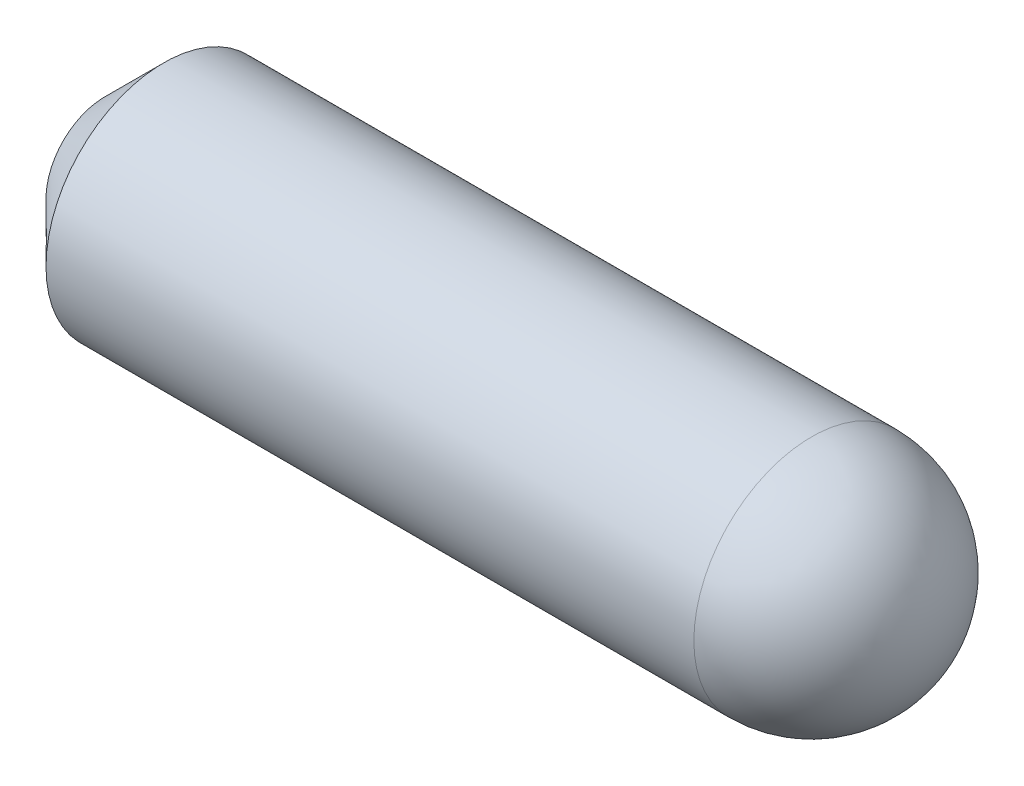
ISO-10303-21;
HEADER;
FILE_DESCRIPTION(('STEP AP214'),'2;1');
FILE_NAME('part.step','',(''),(''),'','','');
FILE_SCHEMA(('AUTOMOTIVE_DESIGN { 1 0 10303 214 1 1 1 1 }'));
ENDSEC;
DATA;
#1=APPLICATION_CONTEXT('core data for automotive mechanical design processes');
#2=APPLICATION_PROTOCOL_DEFINITION('international standard','automotive_design',2000,#1);
#3=PRODUCT_CONTEXT('',#1,'mechanical');
#4=PRODUCT('Part','Part','',(#3));
#5=PRODUCT_RELATED_PRODUCT_CATEGORY('part','',(#4));
#6=PRODUCT_DEFINITION_FORMATION('','',#4);
#7=PRODUCT_DEFINITION_CONTEXT('part definition',#1,'design');
#8=PRODUCT_DEFINITION('design','',#6,#7);
#9=PRODUCT_DEFINITION_SHAPE('','',#8);
#10=(LENGTH_UNIT() NAMED_UNIT(*) SI_UNIT(.MILLI.,.METRE.));
#11=(NAMED_UNIT(*) PLANE_ANGLE_UNIT() SI_UNIT($,.RADIAN.));
#12=(NAMED_UNIT(*) SI_UNIT($,.STERADIAN.) SOLID_ANGLE_UNIT());
#13=UNCERTAINTY_MEASURE_WITH_UNIT(LENGTH_MEASURE(1.E-05),#10,'distance_accuracy_value','');
#14=(GEOMETRIC_REPRESENTATION_CONTEXT(3) GLOBAL_UNCERTAINTY_ASSIGNED_CONTEXT((#13)) GLOBAL_UNIT_ASSIGNED_CONTEXT((#10,
#11,#12)) REPRESENTATION_CONTEXT('',''));
#15=CARTESIAN_POINT('',(0.,0.,0.));
#16=DIRECTION('',(0.,0.,1.));
#17=DIRECTION('',(1.,0.,0.));
#18=AXIS2_PLACEMENT_3D('',#15,#16,#17);
#19=CARTESIAN_POINT('',(0.,0.,0.));
#20=DIRECTION('',(1.,0.,0.));
#21=DIRECTION('',(0.,0.,-1.));
#22=AXIS2_PLACEMENT_3D('',#19,#20,#21);
#23=PLANE('',#22);
#24=CARTESIAN_POINT('',(0.,0.,0.));
#25=DIRECTION('',(1.,0.,0.));
#26=DIRECTION('',(0.,0.,-1.));
#27=AXIS2_PLACEMENT_3D('',#24,#25,#26);
#28=CIRCLE('',#27,0.999999999999999);
#29=CARTESIAN_POINT('',(0.,0.,-0.999999999999999));
#30=VERTEX_POINT('',#29);
#31=EDGE_CURVE('E46',#30,#30,#28,.F.);
#32=ORIENTED_EDGE('',*,*,#31,.T.);
#33=EDGE_LOOP('',(#32));
#34=FACE_BOUND('',#33,.T.);
#35=ADVANCED_FACE('F35',(#34),#23,.F.);
#36=CARTESIAN_POINT('',(-4.80150048085329,0.,0.));
#37=DIRECTION('',(-1.,0.,0.));
#38=DIRECTION('',(0.,0.,1.));
#39=AXIS2_PLACEMENT_3D('',#36,#37,#38);
#40=CYLINDRICAL_SURFACE('',#39,2.);
#41=CARTESIAN_POINT('',(12.,0.,0.));
#42=DIRECTION('',(-1.,0.,0.));
#43=DIRECTION('',(0.,0.,1.));
#44=AXIS2_PLACEMENT_3D('',#41,#42,#43);
#45=CIRCLE('',#44,2.);
#46=CARTESIAN_POINT('',(12.,0.,2.));
#47=VERTEX_POINT('',#46);
#48=EDGE_CURVE('E10',#47,#47,#45,.T.);
#49=ORIENTED_EDGE('',*,*,#48,.T.);
#50=EDGE_LOOP('',(#49));
#51=FACE_BOUND('',#50,.T.);
#52=CARTESIAN_POINT('',(1.,0.,0.));
#53=DIRECTION('',(1.,0.,0.));
#54=DIRECTION('',(0.,0.,-1.));
#55=AXIS2_PLACEMENT_3D('',#52,#53,#54);
#56=CIRCLE('',#55,2.);
#57=CARTESIAN_POINT('',(1.,0.,-2.));
#58=VERTEX_POINT('',#57);
#59=EDGE_CURVE('E42',#58,#58,#56,.T.);
#60=ORIENTED_EDGE('',*,*,#59,.T.);
#61=EDGE_LOOP('',(#60));
#62=FACE_BOUND('',#61,.T.);
#63=ADVANCED_FACE('F56',(#51,#62),#40,.T.);
#64=CARTESIAN_POINT('',(0.,0.,0.));
#65=DIRECTION('',(1.,0.,0.));
#66=DIRECTION('',(0.,0.,-1.));
#67=AXIS2_PLACEMENT_3D('',#64,#65,#66);
#68=CONICAL_SURFACE('',#67,0.999999999999999,0.785398163397447);
#69=ORIENTED_EDGE('',*,*,#59,.F.);
#70=EDGE_LOOP('',(#69));
#71=FACE_BOUND('',#70,.T.);
#72=ORIENTED_EDGE('',*,*,#31,.F.);
#73=EDGE_LOOP('',(#72));
#74=FACE_BOUND('',#73,.T.);
#75=ADVANCED_FACE('F54',(#71,#74),#68,.T.);
#76=CARTESIAN_POINT('',(12.,0.,0.));
#77=DIRECTION('',(0.,0.,1.));
#78=DIRECTION('',(1.,0.,0.));
#79=AXIS2_PLACEMENT_3D('',#76,#77,#78);
#80=SPHERICAL_SURFACE('',#79,2.);
#81=CARTESIAN_POINT('',(12.,0.,0.));
#82=DIRECTION('',(-1.,0.,0.));
#83=DIRECTION('',(0.,0.,1.));
#84=AXIS2_PLACEMENT_3D('',#81,#82,#83);
#85=SPHERICAL_SURFACE('',#84,2.);
#86=ORIENTED_EDGE('',*,*,#48,.F.);
#87=EDGE_LOOP('',(#86));
#88=FACE_BOUND('',#87,.T.);
#89=ADVANCED_FACE('F37',(#88),#85,.T.);
#90=CLOSED_SHELL('',(#35,#63,#75,#89));
#91=MANIFOLD_SOLID_BREP('B2',#90);
#92=ADVANCED_BREP_SHAPE_REPRESENTATION('',(#18,#91),#14);
#93=SHAPE_DEFINITION_REPRESENTATION(#9,#92);
ENDSEC;
END-ISO-10303-21;
